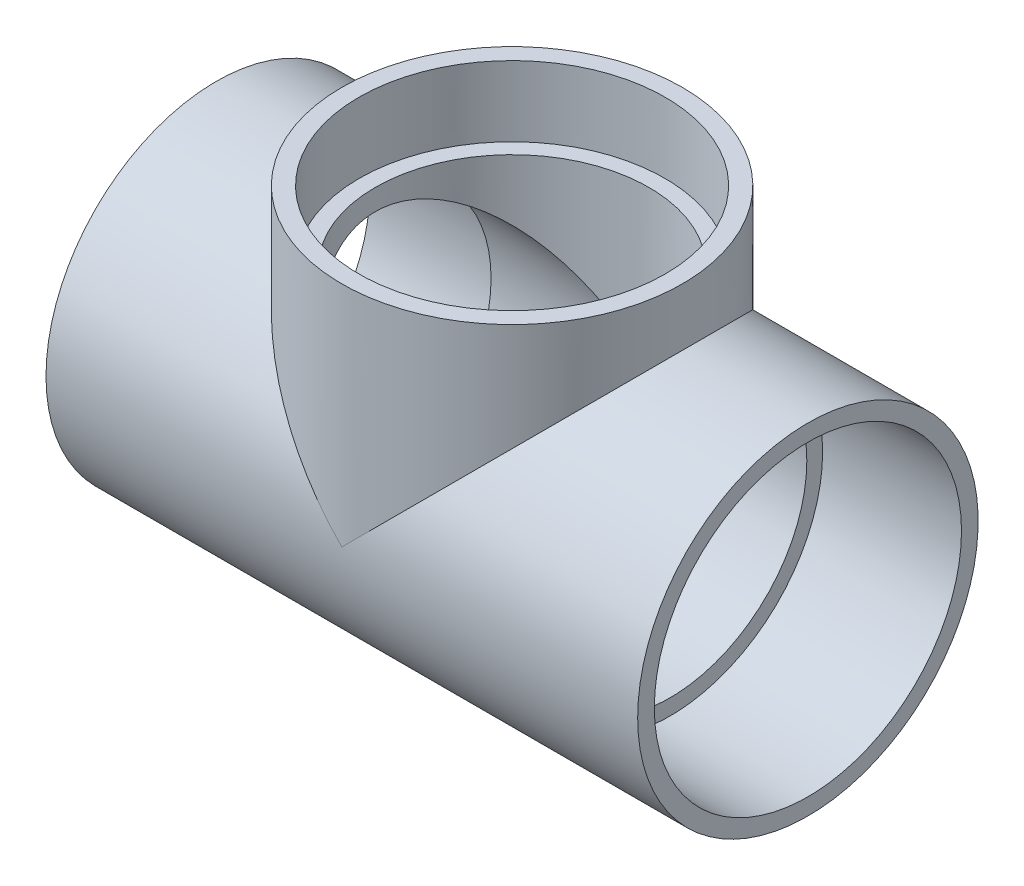
ISO-10303-21;
HEADER;
FILE_DESCRIPTION(('STEP AP214'),'2;1');
FILE_NAME('part.step','',(''),(''),'','','');
FILE_SCHEMA(('AUTOMOTIVE_DESIGN { 1 0 10303 214 1 1 1 1 }'));
ENDSEC;
DATA;
#1=APPLICATION_CONTEXT('core data for automotive mechanical design processes');
#2=APPLICATION_PROTOCOL_DEFINITION('international standard','automotive_design',2000,#1);
#3=PRODUCT_CONTEXT('',#1,'mechanical');
#4=PRODUCT('Part','Part','',(#3));
#5=PRODUCT_RELATED_PRODUCT_CATEGORY('part','',(#4));
#6=PRODUCT_DEFINITION_FORMATION('','',#4);
#7=PRODUCT_DEFINITION_CONTEXT('part definition',#1,'design');
#8=PRODUCT_DEFINITION('design','',#6,#7);
#9=PRODUCT_DEFINITION_SHAPE('','',#8);
#10=(LENGTH_UNIT() NAMED_UNIT(*) SI_UNIT(.MILLI.,.METRE.));
#11=(NAMED_UNIT(*) PLANE_ANGLE_UNIT() SI_UNIT($,.RADIAN.));
#12=(NAMED_UNIT(*) SI_UNIT($,.STERADIAN.) SOLID_ANGLE_UNIT());
#13=UNCERTAINTY_MEASURE_WITH_UNIT(LENGTH_MEASURE(1.E-05),#10,'distance_accuracy_value','');
#14=(GEOMETRIC_REPRESENTATION_CONTEXT(3) GLOBAL_UNCERTAINTY_ASSIGNED_CONTEXT((#13)) GLOBAL_UNIT_ASSIGNED_CONTEXT((#10,
#11,#12)) REPRESENTATION_CONTEXT('',''));
#15=CARTESIAN_POINT('',(0.,0.,0.));
#16=DIRECTION('',(0.,0.,1.));
#17=DIRECTION('',(1.,0.,0.));
#18=AXIS2_PLACEMENT_3D('',#15,#16,#17);
#19=CARTESIAN_POINT('',(0.,110.5154,0.));
#20=DIRECTION('',(0.,1.,0.));
#21=DIRECTION('',(-1.,0.,0.));
#22=AXIS2_PLACEMENT_3D('',#19,#20,#21);
#23=CONICAL_SURFACE('',#22,57.3786,0.00665342572354841);
#24=CARTESIAN_POINT('',(0.,58.9788,0.));
#25=DIRECTION('',(0.,-1.,0.));
#26=DIRECTION('',(1.,0.,0.));
#27=AXIS2_PLACEMENT_3D('',#24,#25,#26);
#28=CIRCLE('',#27,57.0357);
#29=CARTESIAN_POINT('',(57.0357,58.9788,0.));
#30=VERTEX_POINT('',#29);
#31=EDGE_CURVE('E99',#30,#30,#28,.T.);
#32=ORIENTED_EDGE('',*,*,#31,.T.);
#33=EDGE_LOOP('',(#32));
#34=FACE_BOUND('',#33,.T.);
#35=CARTESIAN_POINT('',(0.,85.1154,0.));
#36=DIRECTION('',(0.,1.,0.));
#37=DIRECTION('',(-1.,0.,0.));
#38=AXIS2_PLACEMENT_3D('',#35,#36,#37);
#39=CIRCLE('',#38,57.2096004928536);
#40=CARTESIAN_POINT('',(-57.2096004928536,85.1154,0.));
#41=VERTEX_POINT('',#40);
#42=EDGE_CURVE('E133',#41,#41,#39,.T.);
#43=ORIENTED_EDGE('',*,*,#42,.T.);
#44=EDGE_LOOP('',(#43));
#45=FACE_BOUND('',#44,.T.);
#46=ADVANCED_FACE('F33',(#34,#45),#23,.F.);
#47=CARTESIAN_POINT('',(0.,0.,0.));
#48=DIRECTION('',(0.,-1.,0.));
#49=DIRECTION('',(1.,0.,0.));
#50=AXIS2_PLACEMENT_3D('',#47,#48,#49);
#51=CYLINDRICAL_SURFACE('',#50,63.6016);
#52=CARTESIAN_POINT('',(0.,0.,0.));
#53=DIRECTION('',(0.707106781186547,-0.707106781186547,0.));
#54=DIRECTION('',(-0.707106781186547,-0.707106781186547,0.));
#55=AXIS2_PLACEMENT_3D('',#52,#53,#54);
#56=ELLIPSE('',#55,89.9462453086286,63.6016);
#57=CARTESIAN_POINT('',(0.,0.,-63.6016));
#58=VERTEX_POINT('',#57);
#59=CARTESIAN_POINT('',(0.,0.,63.6016));
#60=VERTEX_POINT('',#59);
#61=EDGE_CURVE('E53',#58,#60,#56,.T.);
#62=ORIENTED_EDGE('',*,*,#61,.F.);
#63=CARTESIAN_POINT('',(0.,0.,0.));
#64=DIRECTION('',(-0.707106781186547,-0.707106781186547,0.));
#65=DIRECTION('',(0.707106781186547,-0.707106781186547,0.));
#66=AXIS2_PLACEMENT_3D('',#63,#64,#65);
#67=ELLIPSE('',#66,89.9462453086286,63.6016);
#68=EDGE_CURVE('E97',#60,#58,#67,.T.);
#69=ORIENTED_EDGE('',*,*,#68,.F.);
#70=EDGE_LOOP('',(#62,#69));
#71=FACE_BOUND('',#70,.T.);
#72=CARTESIAN_POINT('',(0.,85.1154,0.));
#73=DIRECTION('',(0.,1.,0.));
#74=DIRECTION('',(-1.,0.,0.));
#75=AXIS2_PLACEMENT_3D('',#72,#73,#74);
#76=CIRCLE('',#75,63.6016);
#77=CARTESIAN_POINT('',(-63.6016,85.1154,0.));
#78=VERTEX_POINT('',#77);
#79=EDGE_CURVE('E37',#78,#78,#76,.F.);
#80=ORIENTED_EDGE('',*,*,#79,.T.);
#81=EDGE_LOOP('',(#80));
#82=FACE_BOUND('',#81,.T.);
#83=ADVANCED_FACE('F35',(#71,#82),#51,.T.);
#84=CARTESIAN_POINT('',(-58.9788,0.,0.));
#85=DIRECTION('',(1.,0.,0.));
#86=DIRECTION('',(0.,0.,-1.));
#87=AXIS2_PLACEMENT_3D('',#84,#85,#86);
#88=PLANE('',#87);
#89=CARTESIAN_POINT('',(-58.9788,0.,0.));
#90=DIRECTION('',(-1.,0.,0.));
#91=DIRECTION('',(0.,0.,1.));
#92=AXIS2_PLACEMENT_3D('',#89,#90,#91);
#93=CIRCLE('',#92,57.0357);
#94=CARTESIAN_POINT('',(-58.9788,0.,57.0357));
#95=VERTEX_POINT('',#94);
#96=EDGE_CURVE('E91',#95,#95,#93,.T.);
#97=ORIENTED_EDGE('',*,*,#96,.T.);
#98=EDGE_LOOP('',(#97));
#99=FACE_BOUND('',#98,.T.);
#100=CARTESIAN_POINT('',(-58.9788,0.,0.));
#101=DIRECTION('',(1.,0.,0.));
#102=DIRECTION('',(0.,0.,-1.));
#103=AXIS2_PLACEMENT_3D('',#100,#101,#102);
#104=CIRCLE('',#103,51.1302);
#105=CARTESIAN_POINT('',(-58.9788,0.,-51.1302));
#106=VERTEX_POINT('',#105);
#107=EDGE_CURVE('E74',#106,#106,#104,.T.);
#108=ORIENTED_EDGE('',*,*,#107,.T.);
#109=EDGE_LOOP('',(#108));
#110=FACE_BOUND('',#109,.T.);
#111=ADVANCED_FACE('F110',(#99,#110),#88,.F.);
#112=CARTESIAN_POINT('',(58.9788,0.,0.));
#113=DIRECTION('',(1.,0.,0.));
#114=DIRECTION('',(0.,0.,-1.));
#115=AXIS2_PLACEMENT_3D('',#112,#113,#114);
#116=PLANE('',#115);
#117=CARTESIAN_POINT('',(58.9788,0.,0.));
#118=DIRECTION('',(1.,0.,0.));
#119=DIRECTION('',(0.,0.,-1.));
#120=AXIS2_PLACEMENT_3D('',#117,#118,#119);
#121=CIRCLE('',#120,51.1302);
#122=CARTESIAN_POINT('',(58.9788,0.,-51.1302));
#123=VERTEX_POINT('',#122);
#124=EDGE_CURVE('E71',#123,#123,#121,.T.);
#125=ORIENTED_EDGE('',*,*,#124,.F.);
#126=EDGE_LOOP('',(#125));
#127=FACE_BOUND('',#126,.T.);
#128=CARTESIAN_POINT('',(58.9788,0.,0.));
#129=DIRECTION('',(1.,0.,0.));
#130=DIRECTION('',(0.,0.,-1.));
#131=AXIS2_PLACEMENT_3D('',#128,#129,#130);
#132=CIRCLE('',#131,57.0357);
#133=CARTESIAN_POINT('',(58.9788,0.,-57.0357));
#134=VERTEX_POINT('',#133);
#135=EDGE_CURVE('E61',#134,#134,#132,.F.);
#136=ORIENTED_EDGE('',*,*,#135,.F.);
#137=EDGE_LOOP('',(#136));
#138=FACE_BOUND('',#137,.T.);
#139=ADVANCED_FACE('F107',(#127,#138),#116,.T.);
#140=CARTESIAN_POINT('',(58.9788,0.,0.));
#141=DIRECTION('',(-1.,0.,0.));
#142=DIRECTION('',(0.,0.,1.));
#143=AXIS2_PLACEMENT_3D('',#140,#141,#142);
#144=CYLINDRICAL_SURFACE('',#143,63.6016);
#145=CARTESIAN_POINT('',(-110.5154,0.,0.));
#146=DIRECTION('',(-1.,0.,0.));
#147=DIRECTION('',(0.,0.,1.));
#148=AXIS2_PLACEMENT_3D('',#145,#146,#147);
#149=CIRCLE('',#148,63.6016);
#150=CARTESIAN_POINT('',(-110.5154,0.,63.6016));
#151=VERTEX_POINT('',#150);
#152=EDGE_CURVE('E88',#151,#151,#149,.T.);
#153=ORIENTED_EDGE('',*,*,#152,.F.);
#154=EDGE_LOOP('',(#153));
#155=FACE_BOUND('',#154,.T.);
#156=CARTESIAN_POINT('',(110.5154,0.,0.));
#157=DIRECTION('',(-1.,0.,0.));
#158=DIRECTION('',(0.,0.,1.));
#159=AXIS2_PLACEMENT_3D('',#156,#157,#158);
#160=CIRCLE('',#159,63.6016);
#161=CARTESIAN_POINT('',(110.5154,0.,63.6016));
#162=VERTEX_POINT('',#161);
#163=EDGE_CURVE('E76',#162,#162,#160,.T.);
#164=ORIENTED_EDGE('',*,*,#163,.T.);
#165=EDGE_LOOP('',(#164));
#166=FACE_BOUND('',#165,.T.);
#167=ORIENTED_EDGE('',*,*,#68,.T.);
#168=ORIENTED_EDGE('',*,*,#61,.T.);
#169=EDGE_LOOP('',(#167,#168));
#170=FACE_BOUND('',#169,.T.);
#171=ADVANCED_FACE('F109',(#155,#166,#170),#144,.T.);
#172=CARTESIAN_POINT('',(-58.9788,0.,0.));
#173=DIRECTION('',(-1.,0.,0.));
#174=DIRECTION('',(0.,0.,1.));
#175=AXIS2_PLACEMENT_3D('',#172,#173,#174);
#176=CONICAL_SURFACE('',#175,57.0357,0.00665342572354842);
#177=CARTESIAN_POINT('',(-110.5154,0.,0.));
#178=DIRECTION('',(-1.,0.,0.));
#179=DIRECTION('',(0.,0.,1.));
#180=AXIS2_PLACEMENT_3D('',#177,#178,#179);
#181=CIRCLE('',#180,57.3786);
#182=CARTESIAN_POINT('',(-110.5154,0.,57.3786));
#183=VERTEX_POINT('',#182);
#184=EDGE_CURVE('E94',#183,#183,#181,.T.);
#185=ORIENTED_EDGE('',*,*,#184,.T.);
#186=EDGE_LOOP('',(#185));
#187=FACE_BOUND('',#186,.T.);
#188=ORIENTED_EDGE('',*,*,#96,.F.);
#189=EDGE_LOOP('',(#188));
#190=FACE_BOUND('',#189,.T.);
#191=ADVANCED_FACE('F117',(#187,#190),#176,.F.);
#192=CARTESIAN_POINT('',(110.5154,0.,0.));
#193=DIRECTION('',(1.,0.,0.));
#194=DIRECTION('',(0.,0.,-1.));
#195=AXIS2_PLACEMENT_3D('',#192,#193,#194);
#196=CONICAL_SURFACE('',#195,57.3786,0.00665342572354815);
#197=CARTESIAN_POINT('',(110.5154,0.,0.));
#198=DIRECTION('',(-1.,0.,0.));
#199=DIRECTION('',(0.,0.,1.));
#200=AXIS2_PLACEMENT_3D('',#197,#198,#199);
#201=CIRCLE('',#200,57.3786);
#202=CARTESIAN_POINT('',(110.5154,0.,57.3786));
#203=VERTEX_POINT('',#202);
#204=EDGE_CURVE('E79',#203,#203,#201,.T.);
#205=ORIENTED_EDGE('',*,*,#204,.F.);
#206=EDGE_LOOP('',(#205));
#207=FACE_BOUND('',#206,.T.);
#208=ORIENTED_EDGE('',*,*,#135,.T.);
#209=EDGE_LOOP('',(#208));
#210=FACE_BOUND('',#209,.T.);
#211=ADVANCED_FACE('F105',(#207,#210),#196,.F.);
#212=CARTESIAN_POINT('',(-110.5154,-63.6016,0.));
#213=DIRECTION('',(-1.,0.,0.));
#214=DIRECTION('',(0.,0.,1.));
#215=AXIS2_PLACEMENT_3D('',#212,#213,#214);
#216=PLANE('',#215);
#217=ORIENTED_EDGE('',*,*,#152,.T.);
#218=EDGE_LOOP('',(#217));
#219=FACE_BOUND('',#218,.T.);
#220=ORIENTED_EDGE('',*,*,#184,.F.);
#221=EDGE_LOOP('',(#220));
#222=FACE_BOUND('',#221,.T.);
#223=ADVANCED_FACE('F156',(#219,#222),#216,.T.);
#224=CARTESIAN_POINT('',(110.5154,-63.6016,0.));
#225=DIRECTION('',(1.,0.,0.));
#226=DIRECTION('',(0.,0.,-1.));
#227=AXIS2_PLACEMENT_3D('',#224,#225,#226);
#228=PLANE('',#227);
#229=ORIENTED_EDGE('',*,*,#204,.T.);
#230=EDGE_LOOP('',(#229));
#231=FACE_BOUND('',#230,.T.);
#232=ORIENTED_EDGE('',*,*,#163,.F.);
#233=EDGE_LOOP('',(#232));
#234=FACE_BOUND('',#233,.T.);
#235=ADVANCED_FACE('F152',(#231,#234),#228,.T.);
#236=CARTESIAN_POINT('',(0.,58.9788,0.));
#237=DIRECTION('',(0.,-1.,0.));
#238=DIRECTION('',(1.,0.,0.));
#239=AXIS2_PLACEMENT_3D('',#236,#237,#238);
#240=PLANE('',#239);
#241=CARTESIAN_POINT('',(0.,58.9788,0.));
#242=DIRECTION('',(0.,-1.,0.));
#243=DIRECTION('',(1.,0.,0.));
#244=AXIS2_PLACEMENT_3D('',#241,#242,#243);
#245=CIRCLE('',#244,51.1302);
#246=CARTESIAN_POINT('',(51.1302,58.9788,0.));
#247=VERTEX_POINT('',#246);
#248=EDGE_CURVE('E81',#247,#247,#245,.T.);
#249=ORIENTED_EDGE('',*,*,#248,.T.);
#250=EDGE_LOOP('',(#249));
#251=FACE_BOUND('',#250,.T.);
#252=ORIENTED_EDGE('',*,*,#31,.F.);
#253=EDGE_LOOP('',(#252));
#254=FACE_BOUND('',#253,.T.);
#255=ADVANCED_FACE('F66',(#251,#254),#240,.F.);
#256=CARTESIAN_POINT('',(110.5154,0.,0.));
#257=DIRECTION('',(1.,0.,0.));
#258=DIRECTION('',(0.,0.,-1.));
#259=AXIS2_PLACEMENT_3D('',#256,#257,#258);
#260=CYLINDRICAL_SURFACE('',#259,51.1302);
#261=CARTESIAN_POINT('',(0.,0.,0.));
#262=DIRECTION('',(0.707106781186547,-0.707106781186547,0.));
#263=DIRECTION('',(0.707106781186547,0.707106781186547,0.));
#264=AXIS2_PLACEMENT_3D('',#261,#262,#263);
#265=ELLIPSE('',#264,72.3090222868488,51.1302);
#266=CARTESIAN_POINT('',(0.,0.,-51.1302));
#267=VERTEX_POINT('',#266);
#268=CARTESIAN_POINT('',(0.,0.,51.1302));
#269=VERTEX_POINT('',#268);
#270=EDGE_CURVE('E11',#267,#269,#265,.T.);
#271=ORIENTED_EDGE('',*,*,#270,.F.);
#272=CARTESIAN_POINT('',(0.,0.,0.));
#273=DIRECTION('',(0.707106781186547,0.707106781186547,0.));
#274=DIRECTION('',(0.707106781186547,-0.707106781186547,0.));
#275=AXIS2_PLACEMENT_3D('',#272,#273,#274);
#276=ELLIPSE('',#275,72.3090222868488,51.1302);
#277=EDGE_CURVE('E42',#269,#267,#276,.F.);
#278=ORIENTED_EDGE('',*,*,#277,.F.);
#279=EDGE_LOOP('',(#271,#278));
#280=FACE_BOUND('',#279,.T.);
#281=ORIENTED_EDGE('',*,*,#124,.T.);
#282=EDGE_LOOP('',(#281));
#283=FACE_BOUND('',#282,.T.);
#284=ORIENTED_EDGE('',*,*,#107,.F.);
#285=EDGE_LOOP('',(#284));
#286=FACE_BOUND('',#285,.T.);
#287=ADVANCED_FACE('F63',(#280,#283,#286),#260,.F.);
#288=CARTESIAN_POINT('',(0.,0.,0.));
#289=DIRECTION('',(0.,-1.,0.));
#290=DIRECTION('',(1.,0.,0.));
#291=AXIS2_PLACEMENT_3D('',#288,#289,#290);
#292=CYLINDRICAL_SURFACE('',#291,51.1302);
#293=ORIENTED_EDGE('',*,*,#270,.T.);
#294=ORIENTED_EDGE('',*,*,#277,.T.);
#295=EDGE_LOOP('',(#293,#294));
#296=FACE_BOUND('',#295,.T.);
#297=ORIENTED_EDGE('',*,*,#248,.F.);
#298=EDGE_LOOP('',(#297));
#299=FACE_BOUND('',#298,.T.);
#300=ADVANCED_FACE('F58',(#296,#299),#292,.F.);
#301=CARTESIAN_POINT('',(0.,85.1154,0.));
#302=DIRECTION('',(0.,1.,0.));
#303=DIRECTION('',(-1.,0.,0.));
#304=AXIS2_PLACEMENT_3D('',#301,#302,#303);
#305=PLANE('',#304);
#306=ORIENTED_EDGE('',*,*,#42,.F.);
#307=EDGE_LOOP('',(#306));
#308=FACE_BOUND('',#307,.T.);
#309=ORIENTED_EDGE('',*,*,#79,.F.);
#310=EDGE_LOOP('',(#309));
#311=FACE_BOUND('',#310,.T.);
#312=ADVANCED_FACE('F141',(#308,#311),#305,.T.);
#313=CLOSED_SHELL('',(#46,#83,#111,#139,#171,#191,#211,#223,#235,#255,#287,#300,#312));
#314=MANIFOLD_SOLID_BREP('B2',#313);
#315=ADVANCED_BREP_SHAPE_REPRESENTATION('',(#18,#314),#14);
#316=SHAPE_DEFINITION_REPRESENTATION(#9,#315);
ENDSEC;
END-ISO-10303-21;
